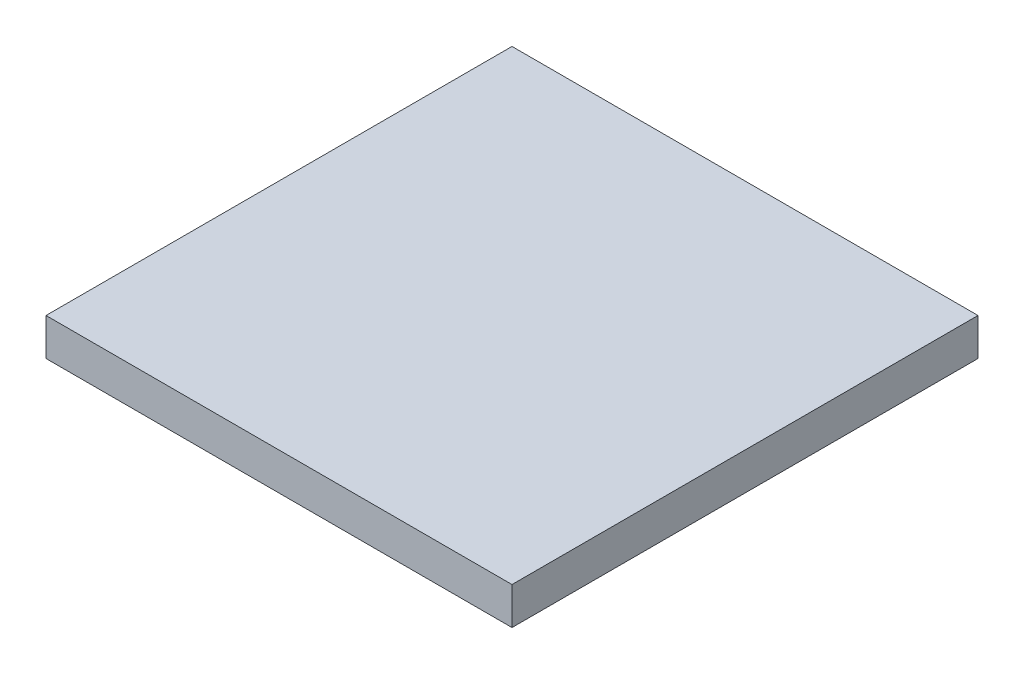
ISO-10303-21;
HEADER;
FILE_DESCRIPTION(('STEP AP214'),'2;1');
FILE_NAME('part.step','',(''),(''),'','','');
FILE_SCHEMA(('AUTOMOTIVE_DESIGN { 1 0 10303 214 1 1 1 1 }'));
ENDSEC;
DATA;
#1=APPLICATION_CONTEXT('core data for automotive mechanical design processes');
#2=APPLICATION_PROTOCOL_DEFINITION('international standard','automotive_design',2000,#1);
#3=PRODUCT_CONTEXT('',#1,'mechanical');
#4=PRODUCT('Part','Part','',(#3));
#5=PRODUCT_RELATED_PRODUCT_CATEGORY('part','',(#4));
#6=PRODUCT_DEFINITION_FORMATION('','',#4);
#7=PRODUCT_DEFINITION_CONTEXT('part definition',#1,'design');
#8=PRODUCT_DEFINITION('design','',#6,#7);
#9=PRODUCT_DEFINITION_SHAPE('','',#8);
#10=(LENGTH_UNIT() NAMED_UNIT(*) SI_UNIT(.MILLI.,.METRE.));
#11=(NAMED_UNIT(*) PLANE_ANGLE_UNIT() SI_UNIT($,.RADIAN.));
#12=(NAMED_UNIT(*) SI_UNIT($,.STERADIAN.) SOLID_ANGLE_UNIT());
#13=UNCERTAINTY_MEASURE_WITH_UNIT(LENGTH_MEASURE(1.E-05),#10,'distance_accuracy_value','');
#14=(GEOMETRIC_REPRESENTATION_CONTEXT(3) GLOBAL_UNCERTAINTY_ASSIGNED_CONTEXT((#13)) GLOBAL_UNIT_ASSIGNED_CONTEXT((#10,
#11,#12)) REPRESENTATION_CONTEXT('',''));
#15=CARTESIAN_POINT('',(0.,0.,0.));
#16=DIRECTION('',(0.,0.,1.));
#17=DIRECTION('',(1.,0.,0.));
#18=AXIS2_PLACEMENT_3D('',#15,#16,#17);
#19=CARTESIAN_POINT('',(125.,20.,-125.));
#20=DIRECTION('',(1.,0.,0.));
#21=DIRECTION('',(0.,0.,-1.));
#22=AXIS2_PLACEMENT_3D('',#19,#20,#21);
#23=PLANE('',#22);
#24=DIRECTION('',(0.,0.,1.));
#25=VECTOR('',#24,1.);
#26=CARTESIAN_POINT('',(125.,0.,-125.));
#27=LINE('',#26,#25);
#28=CARTESIAN_POINT('',(125.,0.,-125.));
#29=VERTEX_POINT('',#28);
#30=CARTESIAN_POINT('',(125.,0.,125.));
#31=VERTEX_POINT('',#30);
#32=EDGE_CURVE('E97',#29,#31,#27,.T.);
#33=ORIENTED_EDGE('',*,*,#32,.F.);
#34=DIRECTION('',(0.,-1.,0.));
#35=VECTOR('',#34,1.);
#36=CARTESIAN_POINT('',(125.,20.,-125.));
#37=LINE('',#36,#35);
#38=CARTESIAN_POINT('',(125.,20.,-125.));
#39=VERTEX_POINT('',#38);
#40=EDGE_CURVE('E11',#39,#29,#37,.T.);
#41=ORIENTED_EDGE('',*,*,#40,.F.);
#42=DIRECTION('',(0.,0.,1.));
#43=VECTOR('',#42,1.);
#44=CARTESIAN_POINT('',(125.,20.,-125.));
#45=LINE('',#44,#43);
#46=CARTESIAN_POINT('',(125.,20.,125.));
#47=VERTEX_POINT('',#46);
#48=EDGE_CURVE('E92',#39,#47,#45,.T.);
#49=ORIENTED_EDGE('',*,*,#48,.T.);
#50=DIRECTION('',(0.,-1.,0.));
#51=VECTOR('',#50,1.);
#52=CARTESIAN_POINT('',(125.,20.,125.));
#53=LINE('',#52,#51);
#54=EDGE_CURVE('E35',#47,#31,#53,.T.);
#55=ORIENTED_EDGE('',*,*,#54,.T.);
#56=EDGE_LOOP('',(#33,#41,#49,#55));
#57=FACE_BOUND('',#56,.T.);
#58=ADVANCED_FACE('F32',(#57),#23,.T.);
#59=CARTESIAN_POINT('',(125.,20.,-125.));
#60=DIRECTION('',(0.,0.,1.));
#61=DIRECTION('',(1.,0.,0.));
#62=AXIS2_PLACEMENT_3D('',#59,#60,#61);
#63=PLANE('',#62);
#64=DIRECTION('',(-1.,0.,0.));
#65=VECTOR('',#64,1.);
#66=CARTESIAN_POINT('',(125.,0.,-125.));
#67=LINE('',#66,#65);
#68=CARTESIAN_POINT('',(-125.,0.,-125.));
#69=VERTEX_POINT('',#68);
#70=EDGE_CURVE('E65',#29,#69,#67,.T.);
#71=ORIENTED_EDGE('',*,*,#70,.T.);
#72=DIRECTION('',(0.,-1.,0.));
#73=VECTOR('',#72,1.);
#74=CARTESIAN_POINT('',(-125.,20.,-125.));
#75=LINE('',#74,#73);
#76=CARTESIAN_POINT('',(-125.,20.,-125.));
#77=VERTEX_POINT('',#76);
#78=EDGE_CURVE('E41',#77,#69,#75,.T.);
#79=ORIENTED_EDGE('',*,*,#78,.F.);
#80=DIRECTION('',(-1.,0.,0.));
#81=VECTOR('',#80,1.);
#82=CARTESIAN_POINT('',(125.,20.,-125.));
#83=LINE('',#82,#81);
#84=EDGE_CURVE('E82',#39,#77,#83,.T.);
#85=ORIENTED_EDGE('',*,*,#84,.F.);
#86=ORIENTED_EDGE('',*,*,#40,.T.);
#87=EDGE_LOOP('',(#71,#79,#85,#86));
#88=FACE_BOUND('',#87,.T.);
#89=ADVANCED_FACE('F107',(#88),#63,.F.);
#90=CARTESIAN_POINT('',(-125.,20.,-125.));
#91=DIRECTION('',(1.,0.,0.));
#92=DIRECTION('',(0.,0.,-1.));
#93=AXIS2_PLACEMENT_3D('',#90,#91,#92);
#94=PLANE('',#93);
#95=DIRECTION('',(0.,0.,1.));
#96=VECTOR('',#95,1.);
#97=CARTESIAN_POINT('',(-125.,0.,-125.));
#98=LINE('',#97,#96);
#99=CARTESIAN_POINT('',(-125.,0.,125.));
#100=VERTEX_POINT('',#99);
#101=EDGE_CURVE('E89',#69,#100,#98,.T.);
#102=ORIENTED_EDGE('',*,*,#101,.T.);
#103=DIRECTION('',(0.,-1.,0.));
#104=VECTOR('',#103,1.);
#105=CARTESIAN_POINT('',(-125.,20.,125.));
#106=LINE('',#105,#104);
#107=CARTESIAN_POINT('',(-125.,20.,125.));
#108=VERTEX_POINT('',#107);
#109=EDGE_CURVE('E86',#108,#100,#106,.T.);
#110=ORIENTED_EDGE('',*,*,#109,.F.);
#111=DIRECTION('',(0.,0.,1.));
#112=VECTOR('',#111,1.);
#113=CARTESIAN_POINT('',(-125.,20.,-125.));
#114=LINE('',#113,#112);
#115=EDGE_CURVE('E77',#77,#108,#114,.T.);
#116=ORIENTED_EDGE('',*,*,#115,.F.);
#117=ORIENTED_EDGE('',*,*,#78,.T.);
#118=EDGE_LOOP('',(#102,#110,#116,#117));
#119=FACE_BOUND('',#118,.T.);
#120=ADVANCED_FACE('F87',(#119),#94,.F.);
#121=CARTESIAN_POINT('',(125.,20.,125.));
#122=DIRECTION('',(0.,0.,1.));
#123=DIRECTION('',(1.,0.,0.));
#124=AXIS2_PLACEMENT_3D('',#121,#122,#123);
#125=PLANE('',#124);
#126=DIRECTION('',(-1.,0.,0.));
#127=VECTOR('',#126,1.);
#128=CARTESIAN_POINT('',(125.,0.,125.));
#129=LINE('',#128,#127);
#130=EDGE_CURVE('E100',#31,#100,#129,.T.);
#131=ORIENTED_EDGE('',*,*,#130,.F.);
#132=ORIENTED_EDGE('',*,*,#54,.F.);
#133=DIRECTION('',(-1.,0.,0.));
#134=VECTOR('',#133,1.);
#135=CARTESIAN_POINT('',(125.,20.,125.));
#136=LINE('',#135,#134);
#137=EDGE_CURVE('E81',#47,#108,#136,.T.);
#138=ORIENTED_EDGE('',*,*,#137,.T.);
#139=ORIENTED_EDGE('',*,*,#109,.T.);
#140=EDGE_LOOP('',(#131,#132,#138,#139));
#141=FACE_BOUND('',#140,.T.);
#142=ADVANCED_FACE('F91',(#141),#125,.T.);
#143=CARTESIAN_POINT('',(0.,20.,0.));
#144=DIRECTION('',(0.,-1.,0.));
#145=DIRECTION('',(0.,0.,-1.));
#146=AXIS2_PLACEMENT_3D('',#143,#144,#145);
#147=PLANE('',#146);
#148=ORIENTED_EDGE('',*,*,#48,.F.);
#149=ORIENTED_EDGE('',*,*,#84,.T.);
#150=ORIENTED_EDGE('',*,*,#115,.T.);
#151=ORIENTED_EDGE('',*,*,#137,.F.);
#152=EDGE_LOOP('',(#148,#149,#150,#151));
#153=FACE_BOUND('',#152,.T.);
#154=ADVANCED_FACE('F80',(#153),#147,.F.);
#155=CARTESIAN_POINT('',(0.,0.,0.));
#156=DIRECTION('',(0.,-1.,0.));
#157=DIRECTION('',(0.,0.,-1.));
#158=AXIS2_PLACEMENT_3D('',#155,#156,#157);
#159=PLANE('',#158);
#160=ORIENTED_EDGE('',*,*,#32,.T.);
#161=ORIENTED_EDGE('',*,*,#130,.T.);
#162=ORIENTED_EDGE('',*,*,#101,.F.);
#163=ORIENTED_EDGE('',*,*,#70,.F.);
#164=EDGE_LOOP('',(#160,#161,#162,#163));
#165=FACE_BOUND('',#164,.T.);
#166=ADVANCED_FACE('F105',(#165),#159,.T.);
#167=CLOSED_SHELL('',(#58,#89,#120,#142,#154,#166));
#168=MANIFOLD_SOLID_BREP('B2',#167);
#169=ADVANCED_BREP_SHAPE_REPRESENTATION('',(#18,#168),#14);
#170=SHAPE_DEFINITION_REPRESENTATION(#9,#169);
ENDSEC;
END-ISO-10303-21;
